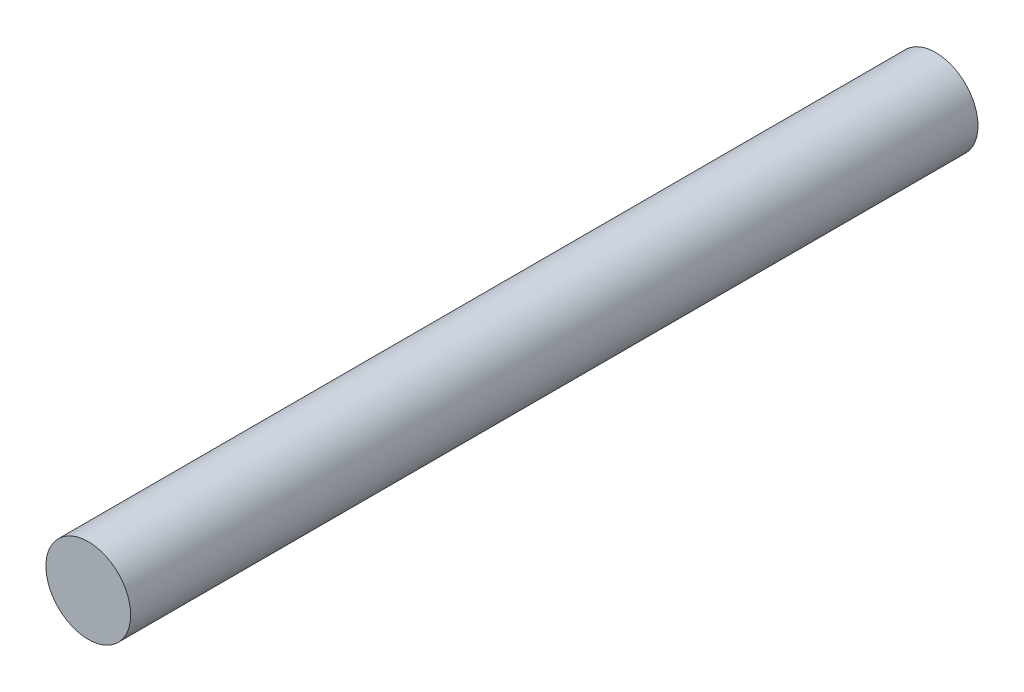
ISO-10303-21;
HEADER;
FILE_DESCRIPTION(('STEP AP214'),'2;1');
FILE_NAME('part.step','',(''),(''),'','','');
FILE_SCHEMA(('AUTOMOTIVE_DESIGN { 1 0 10303 214 1 1 1 1 }'));
ENDSEC;
DATA;
#1=APPLICATION_CONTEXT('core data for automotive mechanical design processes');
#2=APPLICATION_PROTOCOL_DEFINITION('international standard','automotive_design',2000,#1);
#3=PRODUCT_CONTEXT('',#1,'mechanical');
#4=PRODUCT('Part','Part','',(#3));
#5=PRODUCT_RELATED_PRODUCT_CATEGORY('part','',(#4));
#6=PRODUCT_DEFINITION_FORMATION('','',#4);
#7=PRODUCT_DEFINITION_CONTEXT('part definition',#1,'design');
#8=PRODUCT_DEFINITION('design','',#6,#7);
#9=PRODUCT_DEFINITION_SHAPE('','',#8);
#10=(LENGTH_UNIT() NAMED_UNIT(*) SI_UNIT(.MILLI.,.METRE.));
#11=(NAMED_UNIT(*) PLANE_ANGLE_UNIT() SI_UNIT($,.RADIAN.));
#12=(NAMED_UNIT(*) SI_UNIT($,.STERADIAN.) SOLID_ANGLE_UNIT());
#13=UNCERTAINTY_MEASURE_WITH_UNIT(LENGTH_MEASURE(1.E-05),#10,'distance_accuracy_value','');
#14=(GEOMETRIC_REPRESENTATION_CONTEXT(3) GLOBAL_UNCERTAINTY_ASSIGNED_CONTEXT((#13)) GLOBAL_UNIT_ASSIGNED_CONTEXT((#10,
#11,#12)) REPRESENTATION_CONTEXT('',''));
#15=CARTESIAN_POINT('',(0.,0.,0.));
#16=DIRECTION('',(0.,0.,1.));
#17=DIRECTION('',(1.,0.,0.));
#18=AXIS2_PLACEMENT_3D('',#15,#16,#17);
#19=CARTESIAN_POINT('',(0.,0.,30.));
#20=DIRECTION('',(0.,0.,-1.));
#21=DIRECTION('',(-1.,0.,0.));
#22=AXIS2_PLACEMENT_3D('',#19,#20,#21);
#23=CYLINDRICAL_SURFACE('',#22,1.5);
#24=CARTESIAN_POINT('',(0.,0.,30.));
#25=DIRECTION('',(0.,0.,1.));
#26=DIRECTION('',(1.,0.,0.));
#27=AXIS2_PLACEMENT_3D('',#24,#25,#26);
#28=CIRCLE('',#27,1.5);
#29=CARTESIAN_POINT('',(1.5,0.,30.));
#30=VERTEX_POINT('',#29);
#31=EDGE_CURVE('E10',#30,#30,#28,.T.);
#32=ORIENTED_EDGE('',*,*,#31,.F.);
#33=EDGE_LOOP('',(#32));
#34=FACE_BOUND('',#33,.T.);
#35=CARTESIAN_POINT('',(0.,0.,0.));
#36=DIRECTION('',(0.,0.,1.));
#37=DIRECTION('',(1.,0.,0.));
#38=AXIS2_PLACEMENT_3D('',#35,#36,#37);
#39=CIRCLE('',#38,1.5);
#40=CARTESIAN_POINT('',(1.5,0.,0.));
#41=VERTEX_POINT('',#40);
#42=EDGE_CURVE('E33',#41,#41,#39,.T.);
#43=ORIENTED_EDGE('',*,*,#42,.T.);
#44=EDGE_LOOP('',(#43));
#45=FACE_BOUND('',#44,.T.);
#46=ADVANCED_FACE('F30',(#34,#45),#23,.T.);
#47=CARTESIAN_POINT('',(0.,0.,30.));
#48=DIRECTION('',(0.,0.,1.));
#49=DIRECTION('',(1.,0.,0.));
#50=AXIS2_PLACEMENT_3D('',#47,#48,#49);
#51=PLANE('',#50);
#52=ORIENTED_EDGE('',*,*,#31,.T.);
#53=EDGE_LOOP('',(#52));
#54=FACE_BOUND('',#53,.T.);
#55=ADVANCED_FACE('F45',(#54),#51,.T.);
#56=CARTESIAN_POINT('',(0.,0.,0.));
#57=DIRECTION('',(0.,0.,1.));
#58=DIRECTION('',(1.,0.,0.));
#59=AXIS2_PLACEMENT_3D('',#56,#57,#58);
#60=PLANE('',#59);
#61=ORIENTED_EDGE('',*,*,#42,.F.);
#62=EDGE_LOOP('',(#61));
#63=FACE_BOUND('',#62,.T.);
#64=ADVANCED_FACE('F43',(#63),#60,.F.);
#65=CLOSED_SHELL('',(#46,#55,#64));
#66=MANIFOLD_SOLID_BREP('B2',#65);
#67=ADVANCED_BREP_SHAPE_REPRESENTATION('',(#18,#66),#14);
#68=SHAPE_DEFINITION_REPRESENTATION(#9,#67);
ENDSEC;
END-ISO-10303-21;
